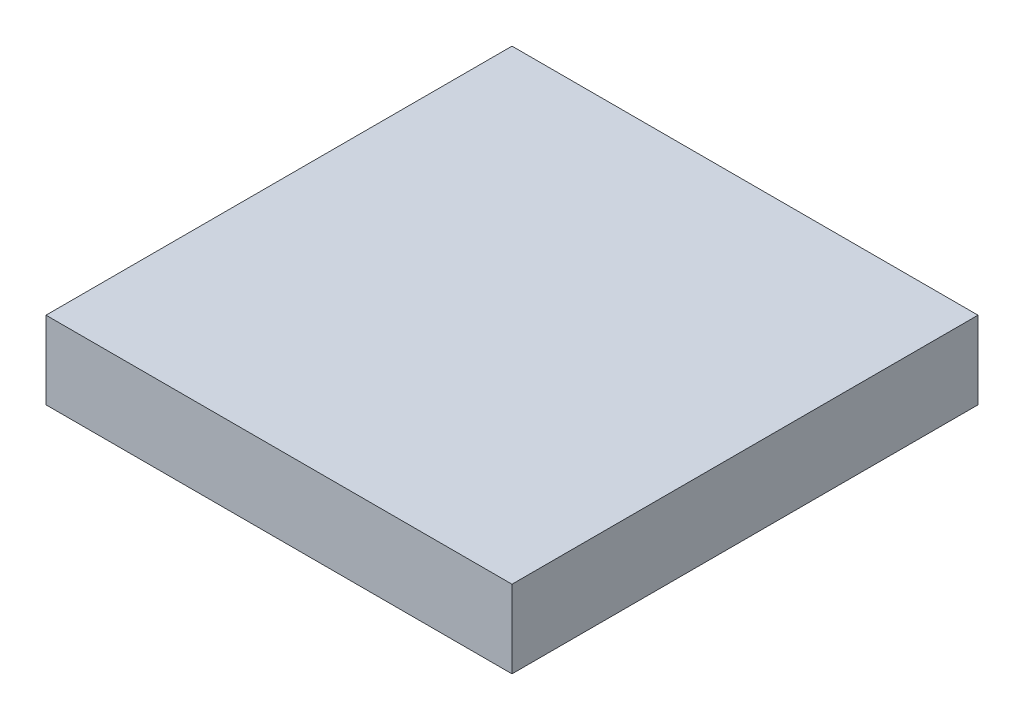
ISO-10303-21;
HEADER;
FILE_DESCRIPTION(('STEP AP214'),'2;1');
FILE_NAME('part.step','',(''),(''),'','','');
FILE_SCHEMA(('AUTOMOTIVE_DESIGN { 1 0 10303 214 1 1 1 1 }'));
ENDSEC;
DATA;
#1=APPLICATION_CONTEXT('core data for automotive mechanical design processes');
#2=APPLICATION_PROTOCOL_DEFINITION('international standard','automotive_design',2000,#1);
#3=PRODUCT_CONTEXT('',#1,'mechanical');
#4=PRODUCT('Part','Part','',(#3));
#5=PRODUCT_RELATED_PRODUCT_CATEGORY('part','',(#4));
#6=PRODUCT_DEFINITION_FORMATION('','',#4);
#7=PRODUCT_DEFINITION_CONTEXT('part definition',#1,'design');
#8=PRODUCT_DEFINITION('design','',#6,#7);
#9=PRODUCT_DEFINITION_SHAPE('','',#8);
#10=(LENGTH_UNIT() NAMED_UNIT(*) SI_UNIT(.MILLI.,.METRE.));
#11=(NAMED_UNIT(*) PLANE_ANGLE_UNIT() SI_UNIT($,.RADIAN.));
#12=(NAMED_UNIT(*) SI_UNIT($,.STERADIAN.) SOLID_ANGLE_UNIT());
#13=UNCERTAINTY_MEASURE_WITH_UNIT(LENGTH_MEASURE(1.E-05),#10,'distance_accuracy_value','');
#14=(GEOMETRIC_REPRESENTATION_CONTEXT(3) GLOBAL_UNCERTAINTY_ASSIGNED_CONTEXT((#13)) GLOBAL_UNIT_ASSIGNED_CONTEXT((#10,
#11,#12)) REPRESENTATION_CONTEXT('',''));
#15=CARTESIAN_POINT('',(0.,0.,0.));
#16=DIRECTION('',(0.,0.,1.));
#17=DIRECTION('',(1.,0.,0.));
#18=AXIS2_PLACEMENT_3D('',#15,#16,#17);
#19=CARTESIAN_POINT('',(-152.4,50.8,152.4));
#20=DIRECTION('',(1.,0.,0.));
#21=DIRECTION('',(0.,0.,-1.));
#22=AXIS2_PLACEMENT_3D('',#19,#20,#21);
#23=PLANE('',#22);
#24=DIRECTION('',(0.,0.,1.));
#25=VECTOR('',#24,1.);
#26=CARTESIAN_POINT('',(-152.4,0.,152.4));
#27=LINE('',#26,#25);
#28=CARTESIAN_POINT('',(-152.4,0.,-152.4));
#29=VERTEX_POINT('',#28);
#30=CARTESIAN_POINT('',(-152.4,0.,152.4));
#31=VERTEX_POINT('',#30);
#32=EDGE_CURVE('E96',#29,#31,#27,.T.);
#33=ORIENTED_EDGE('',*,*,#32,.T.);
#34=DIRECTION('',(0.,-1.,0.));
#35=VECTOR('',#34,1.);
#36=CARTESIAN_POINT('',(-152.4,50.8,152.4));
#37=LINE('',#36,#35);
#38=CARTESIAN_POINT('',(-152.4,50.8,152.4));
#39=VERTEX_POINT('',#38);
#40=EDGE_CURVE('E11',#39,#31,#37,.T.);
#41=ORIENTED_EDGE('',*,*,#40,.F.);
#42=DIRECTION('',(0.,0.,1.));
#43=VECTOR('',#42,1.);
#44=CARTESIAN_POINT('',(-152.4,50.8,152.4));
#45=LINE('',#44,#43);
#46=CARTESIAN_POINT('',(-152.4,50.8,-152.4));
#47=VERTEX_POINT('',#46);
#48=EDGE_CURVE('E84',#47,#39,#45,.T.);
#49=ORIENTED_EDGE('',*,*,#48,.F.);
#50=DIRECTION('',(0.,-1.,0.));
#51=VECTOR('',#50,1.);
#52=CARTESIAN_POINT('',(-152.4,50.8,-152.4));
#53=LINE('',#52,#51);
#54=EDGE_CURVE('E92',#47,#29,#53,.T.);
#55=ORIENTED_EDGE('',*,*,#54,.T.);
#56=EDGE_LOOP('',(#33,#41,#49,#55));
#57=FACE_BOUND('',#56,.T.);
#58=ADVANCED_FACE('F33',(#57),#23,.F.);
#59=CARTESIAN_POINT('',(152.4,50.8,152.4));
#60=DIRECTION('',(0.,0.,-1.));
#61=DIRECTION('',(-1.,0.,0.));
#62=AXIS2_PLACEMENT_3D('',#59,#60,#61);
#63=PLANE('',#62);
#64=DIRECTION('',(1.,0.,0.));
#65=VECTOR('',#64,1.);
#66=CARTESIAN_POINT('',(152.4,0.,152.4));
#67=LINE('',#66,#65);
#68=CARTESIAN_POINT('',(152.4,0.,152.4));
#69=VERTEX_POINT('',#68);
#70=EDGE_CURVE('E88',#31,#69,#67,.T.);
#71=ORIENTED_EDGE('',*,*,#70,.T.);
#72=DIRECTION('',(0.,-1.,0.));
#73=VECTOR('',#72,1.);
#74=CARTESIAN_POINT('',(152.4,50.8,152.4));
#75=LINE('',#74,#73);
#76=CARTESIAN_POINT('',(152.4,50.8,152.4));
#77=VERTEX_POINT('',#76);
#78=EDGE_CURVE('E41',#77,#69,#75,.T.);
#79=ORIENTED_EDGE('',*,*,#78,.F.);
#80=DIRECTION('',(1.,0.,0.));
#81=VECTOR('',#80,1.);
#82=CARTESIAN_POINT('',(152.4,50.8,152.4));
#83=LINE('',#82,#81);
#84=EDGE_CURVE('E79',#39,#77,#83,.T.);
#85=ORIENTED_EDGE('',*,*,#84,.F.);
#86=ORIENTED_EDGE('',*,*,#40,.T.);
#87=EDGE_LOOP('',(#71,#79,#85,#86));
#88=FACE_BOUND('',#87,.T.);
#89=ADVANCED_FACE('F87',(#88),#63,.F.);
#90=CARTESIAN_POINT('',(152.4,50.8,152.4));
#91=DIRECTION('',(-1.,0.,0.));
#92=DIRECTION('',(0.,0.,1.));
#93=AXIS2_PLACEMENT_3D('',#90,#91,#92);
#94=PLANE('',#93);
#95=DIRECTION('',(0.,0.,-1.));
#96=VECTOR('',#95,1.);
#97=CARTESIAN_POINT('',(152.4,0.,152.4));
#98=LINE('',#97,#96);
#99=CARTESIAN_POINT('',(152.4,0.,-152.4));
#100=VERTEX_POINT('',#99);
#101=EDGE_CURVE('E66',#69,#100,#98,.T.);
#102=ORIENTED_EDGE('',*,*,#101,.T.);
#103=DIRECTION('',(0.,-1.,0.));
#104=VECTOR('',#103,1.);
#105=CARTESIAN_POINT('',(152.4,50.8,-152.4));
#106=LINE('',#105,#104);
#107=CARTESIAN_POINT('',(152.4,50.8,-152.4));
#108=VERTEX_POINT('',#107);
#109=EDGE_CURVE('E89',#108,#100,#106,.T.);
#110=ORIENTED_EDGE('',*,*,#109,.F.);
#111=DIRECTION('',(0.,0.,-1.));
#112=VECTOR('',#111,1.);
#113=CARTESIAN_POINT('',(152.4,50.8,152.4));
#114=LINE('',#113,#112);
#115=EDGE_CURVE('E82',#77,#108,#114,.T.);
#116=ORIENTED_EDGE('',*,*,#115,.F.);
#117=ORIENTED_EDGE('',*,*,#78,.T.);
#118=EDGE_LOOP('',(#102,#110,#116,#117));
#119=FACE_BOUND('',#118,.T.);
#120=ADVANCED_FACE('F90',(#119),#94,.F.);
#121=CARTESIAN_POINT('',(152.4,50.8,-152.4));
#122=DIRECTION('',(0.,0.,1.));
#123=DIRECTION('',(1.,0.,0.));
#124=AXIS2_PLACEMENT_3D('',#121,#122,#123);
#125=PLANE('',#124);
#126=DIRECTION('',(-1.,0.,0.));
#127=VECTOR('',#126,1.);
#128=CARTESIAN_POINT('',(152.4,0.,-152.4));
#129=LINE('',#128,#127);
#130=EDGE_CURVE('E72',#100,#29,#129,.T.);
#131=ORIENTED_EDGE('',*,*,#130,.T.);
#132=ORIENTED_EDGE('',*,*,#54,.F.);
#133=DIRECTION('',(-1.,0.,0.));
#134=VECTOR('',#133,1.);
#135=CARTESIAN_POINT('',(152.4,50.8,-152.4));
#136=LINE('',#135,#134);
#137=EDGE_CURVE('E49',#108,#47,#136,.T.);
#138=ORIENTED_EDGE('',*,*,#137,.F.);
#139=ORIENTED_EDGE('',*,*,#109,.T.);
#140=EDGE_LOOP('',(#131,#132,#138,#139));
#141=FACE_BOUND('',#140,.T.);
#142=ADVANCED_FACE('F103',(#141),#125,.F.);
#143=CARTESIAN_POINT('',(0.,50.8,0.));
#144=DIRECTION('',(0.,1.,0.));
#145=DIRECTION('',(0.,0.,1.));
#146=AXIS2_PLACEMENT_3D('',#143,#144,#145);
#147=PLANE('',#146);
#148=ORIENTED_EDGE('',*,*,#48,.T.);
#149=ORIENTED_EDGE('',*,*,#84,.T.);
#150=ORIENTED_EDGE('',*,*,#115,.T.);
#151=ORIENTED_EDGE('',*,*,#137,.T.);
#152=EDGE_LOOP('',(#148,#149,#150,#151));
#153=FACE_BOUND('',#152,.T.);
#154=ADVANCED_FACE('F80',(#153),#147,.T.);
#155=CARTESIAN_POINT('',(0.,0.,0.));
#156=DIRECTION('',(0.,1.,0.));
#157=DIRECTION('',(0.,0.,1.));
#158=AXIS2_PLACEMENT_3D('',#155,#156,#157);
#159=PLANE('',#158);
#160=ORIENTED_EDGE('',*,*,#32,.F.);
#161=ORIENTED_EDGE('',*,*,#130,.F.);
#162=ORIENTED_EDGE('',*,*,#101,.F.);
#163=ORIENTED_EDGE('',*,*,#70,.F.);
#164=EDGE_LOOP('',(#160,#161,#162,#163));
#165=FACE_BOUND('',#164,.T.);
#166=ADVANCED_FACE('F106',(#165),#159,.F.);
#167=CLOSED_SHELL('',(#58,#89,#120,#142,#154,#166));
#168=MANIFOLD_SOLID_BREP('B2',#167);
#169=ADVANCED_BREP_SHAPE_REPRESENTATION('',(#18,#168),#14);
#170=SHAPE_DEFINITION_REPRESENTATION(#9,#169);
ENDSEC;
END-ISO-10303-21;
